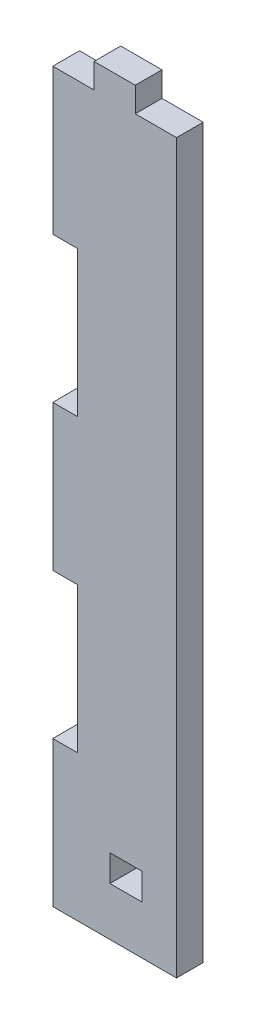
ISO-10303-21;
HEADER;
FILE_DESCRIPTION(('STEP AP214'),'2;1');
FILE_NAME('part.step','',(''),(''),'','','');
FILE_SCHEMA(('AUTOMOTIVE_DESIGN { 1 0 10303 214 1 1 1 1 }'));
ENDSEC;
DATA;
#1=APPLICATION_CONTEXT('core data for automotive mechanical design processes');
#2=APPLICATION_PROTOCOL_DEFINITION('international standard','automotive_design',2000,#1);
#3=PRODUCT_CONTEXT('',#1,'mechanical');
#4=PRODUCT('Part','Part','',(#3));
#5=PRODUCT_RELATED_PRODUCT_CATEGORY('part','',(#4));
#6=PRODUCT_DEFINITION_FORMATION('','',#4);
#7=PRODUCT_DEFINITION_CONTEXT('part definition',#1,'design');
#8=PRODUCT_DEFINITION('design','',#6,#7);
#9=PRODUCT_DEFINITION_SHAPE('','',#8);
#10=(LENGTH_UNIT() NAMED_UNIT(*) SI_UNIT(.MILLI.,.METRE.));
#11=(NAMED_UNIT(*) PLANE_ANGLE_UNIT() SI_UNIT($,.RADIAN.));
#12=(NAMED_UNIT(*) SI_UNIT($,.STERADIAN.) SOLID_ANGLE_UNIT());
#13=UNCERTAINTY_MEASURE_WITH_UNIT(LENGTH_MEASURE(1.E-05),#10,'distance_accuracy_value','');
#14=(GEOMETRIC_REPRESENTATION_CONTEXT(3) GLOBAL_UNCERTAINTY_ASSIGNED_CONTEXT((#13)) GLOBAL_UNIT_ASSIGNED_CONTEXT((#10,
#11,#12)) REPRESENTATION_CONTEXT('',''));
#15=CARTESIAN_POINT('',(0.,0.,0.));
#16=DIRECTION('',(0.,0.,1.));
#17=DIRECTION('',(1.,0.,0.));
#18=AXIS2_PLACEMENT_3D('',#15,#16,#17);
#19=CARTESIAN_POINT('',(0.,150.,5.5));
#20=DIRECTION('',(0.,-1.,0.));
#21=DIRECTION('',(0.,0.,-1.));
#22=AXIS2_PLACEMENT_3D('',#19,#20,#21);
#23=PLANE('',#22);
#24=DIRECTION('',(0.,0.,1.));
#25=VECTOR('',#24,1.);
#26=CARTESIAN_POINT('',(8.49999999999997,150.,-9.91261822123701));
#27=LINE('',#26,#25);
#28=CARTESIAN_POINT('',(8.49999999999997,150.,0.));
#29=VERTEX_POINT('',#28);
#30=CARTESIAN_POINT('',(8.49999999999997,150.,5.5));
#31=VERTEX_POINT('',#30);
#32=EDGE_CURVE('E251',#29,#31,#27,.T.);
#33=ORIENTED_EDGE('',*,*,#32,.F.);
#34=DIRECTION('',(-1.,0.,0.));
#35=VECTOR('',#34,1.);
#36=CARTESIAN_POINT('',(0.,150.,0.));
#37=LINE('',#36,#35);
#38=CARTESIAN_POINT('',(0.,150.,0.));
#39=VERTEX_POINT('',#38);
#40=EDGE_CURVE('E193',#29,#39,#37,.T.);
#41=ORIENTED_EDGE('',*,*,#40,.T.);
#42=DIRECTION('',(0.,0.,-1.));
#43=VECTOR('',#42,1.);
#44=CARTESIAN_POINT('',(0.,150.,5.5));
#45=LINE('',#44,#43);
#46=CARTESIAN_POINT('',(0.,150.,5.5));
#47=VERTEX_POINT('',#46);
#48=EDGE_CURVE('E207',#47,#39,#45,.T.);
#49=ORIENTED_EDGE('',*,*,#48,.F.);
#50=DIRECTION('',(-1.,0.,0.));
#51=VECTOR('',#50,1.);
#52=CARTESIAN_POINT('',(0.,150.,5.5));
#53=LINE('',#52,#51);
#54=EDGE_CURVE('E306',#31,#47,#53,.T.);
#55=ORIENTED_EDGE('',*,*,#54,.F.);
#56=EDGE_LOOP('',(#33,#41,#49,#55));
#57=FACE_BOUND('',#56,.T.);
#58=ADVANCED_FACE('F31',(#57),#23,.F.);
#59=CARTESIAN_POINT('',(0.,0.,5.5));
#60=DIRECTION('',(1.,0.,0.));
#61=DIRECTION('',(0.,1.,0.));
#62=AXIS2_PLACEMENT_3D('',#59,#60,#61);
#63=PLANE('',#62);
#64=DIRECTION('',(0.,0.,1.));
#65=VECTOR('',#64,1.);
#66=CARTESIAN_POINT('',(0.,30.,5.49999999999992));
#67=LINE('',#66,#65);
#68=CARTESIAN_POINT('',(0.,30.,0.));
#69=VERTEX_POINT('',#68);
#70=CARTESIAN_POINT('',(0.,30.,5.5));
#71=VERTEX_POINT('',#70);
#72=EDGE_CURVE('E298',#69,#71,#67,.T.);
#73=ORIENTED_EDGE('',*,*,#72,.F.);
#74=DIRECTION('',(0.,-1.,0.));
#75=VECTOR('',#74,1.);
#76=CARTESIAN_POINT('',(0.,0.,0.));
#77=LINE('',#76,#75);
#78=CARTESIAN_POINT('',(0.,0.,0.));
#79=VERTEX_POINT('',#78);
#80=EDGE_CURVE('E299',#69,#79,#77,.T.);
#81=ORIENTED_EDGE('',*,*,#80,.T.);
#82=DIRECTION('',(0.,0.,-1.));
#83=VECTOR('',#82,1.);
#84=CARTESIAN_POINT('',(0.,0.,5.5));
#85=LINE('',#84,#83);
#86=CARTESIAN_POINT('',(0.,0.,5.5));
#87=VERTEX_POINT('',#86);
#88=EDGE_CURVE('E216',#87,#79,#85,.T.);
#89=ORIENTED_EDGE('',*,*,#88,.F.);
#90=DIRECTION('',(0.,-1.,0.));
#91=VECTOR('',#90,1.);
#92=CARTESIAN_POINT('',(0.,0.,5.5));
#93=LINE('',#92,#91);
#94=EDGE_CURVE('E192',#71,#87,#93,.T.);
#95=ORIENTED_EDGE('',*,*,#94,.F.);
#96=EDGE_LOOP('',(#73,#81,#89,#95));
#97=FACE_BOUND('',#96,.T.);
#98=ADVANCED_FACE('F33',(#97),#63,.F.);
#99=DIRECTION('',(0.,0.,-1.));
#100=VECTOR('',#99,1.);
#101=CARTESIAN_POINT('',(0.,60.,5.50000000000015));
#102=LINE('',#101,#100);
#103=CARTESIAN_POINT('',(0.,60.,5.5));
#104=VERTEX_POINT('',#103);
#105=CARTESIAN_POINT('',(0.,60.,0.));
#106=VERTEX_POINT('',#105);
#107=EDGE_CURVE('E296',#104,#106,#102,.T.);
#108=ORIENTED_EDGE('',*,*,#107,.F.);
#109=CARTESIAN_POINT('',(0.,90.,5.5));
#110=VERTEX_POINT('',#109);
#111=EDGE_CURVE('E195',#110,#104,#93,.T.);
#112=ORIENTED_EDGE('',*,*,#111,.F.);
#113=DIRECTION('',(0.,0.,1.));
#114=VECTOR('',#113,1.);
#115=CARTESIAN_POINT('',(0.,90.,5.49999999999989));
#116=LINE('',#115,#114);
#117=CARTESIAN_POINT('',(0.,90.,0.));
#118=VERTEX_POINT('',#117);
#119=EDGE_CURVE('E294',#118,#110,#116,.T.);
#120=ORIENTED_EDGE('',*,*,#119,.F.);
#121=EDGE_CURVE('E351',#118,#106,#77,.T.);
#122=ORIENTED_EDGE('',*,*,#121,.T.);
#123=EDGE_LOOP('',(#108,#112,#120,#122));
#124=FACE_BOUND('',#123,.T.);
#125=ADVANCED_FACE('F349',(#124),#63,.F.);
#126=DIRECTION('',(0.,0.,-1.));
#127=VECTOR('',#126,1.);
#128=CARTESIAN_POINT('',(0.,120.,5.5));
#129=LINE('',#128,#127);
#130=CARTESIAN_POINT('',(0.,120.,5.5));
#131=VERTEX_POINT('',#130);
#132=CARTESIAN_POINT('',(0.,120.,0.));
#133=VERTEX_POINT('',#132);
#134=EDGE_CURVE('E292',#131,#133,#129,.T.);
#135=ORIENTED_EDGE('',*,*,#134,.F.);
#136=EDGE_CURVE('E197',#47,#131,#93,.T.);
#137=ORIENTED_EDGE('',*,*,#136,.F.);
#138=ORIENTED_EDGE('',*,*,#48,.T.);
#139=EDGE_CURVE('E309',#39,#133,#77,.T.);
#140=ORIENTED_EDGE('',*,*,#139,.T.);
#141=EDGE_LOOP('',(#135,#137,#138,#140));
#142=FACE_BOUND('',#141,.T.);
#143=ADVANCED_FACE('F330',(#142),#63,.F.);
#144=CARTESIAN_POINT('',(0.,150.,5.5));
#145=DIRECTION('',(0.,0.,-1.));
#146=DIRECTION('',(-1.,0.,0.));
#147=AXIS2_PLACEMENT_3D('',#144,#145,#146);
#148=PLANE('',#147);
#149=DIRECTION('',(0.,-1.,0.));
#150=VECTOR('',#149,1.);
#151=CARTESIAN_POINT('',(11.7666666666667,15.5,5.50000000000003));
#152=LINE('',#151,#150);
#153=CARTESIAN_POINT('',(11.7666666666667,15.5,5.50000000000003));
#154=VERTEX_POINT('',#153);
#155=CARTESIAN_POINT('',(11.7666666666667,10.,5.5));
#156=VERTEX_POINT('',#155);
#157=EDGE_CURVE('E56',#154,#156,#152,.T.);
#158=ORIENTED_EDGE('',*,*,#157,.F.);
#159=DIRECTION('',(1.,0.,0.));
#160=VECTOR('',#159,1.);
#161=CARTESIAN_POINT('',(11.7666666666667,15.5,5.50000000000003));
#162=LINE('',#161,#160);
#163=CARTESIAN_POINT('',(18.4333333333334,15.5,5.50000000000003));
#164=VERTEX_POINT('',#163);
#165=EDGE_CURVE('E445',#154,#164,#162,.T.);
#166=ORIENTED_EDGE('',*,*,#165,.T.);
#167=DIRECTION('',(0.,-1.,0.));
#168=VECTOR('',#167,1.);
#169=CARTESIAN_POINT('',(18.4333333333334,15.5,5.50000000000003));
#170=LINE('',#169,#168);
#171=CARTESIAN_POINT('',(18.4333333333334,10.,5.50000000000003));
#172=VERTEX_POINT('',#171);
#173=EDGE_CURVE('E263',#164,#172,#170,.T.);
#174=ORIENTED_EDGE('',*,*,#173,.T.);
#175=DIRECTION('',(1.,0.,0.));
#176=VECTOR('',#175,1.);
#177=CARTESIAN_POINT('',(11.7666666666667,10.,5.50000000000003));
#178=LINE('',#177,#176);
#179=EDGE_CURVE('E250',#156,#172,#178,.T.);
#180=ORIENTED_EDGE('',*,*,#179,.F.);
#181=EDGE_LOOP('',(#158,#166,#174,#180));
#182=FACE_BOUND('',#181,.T.);
#183=DIRECTION('',(1.,0.,0.));
#184=VECTOR('',#183,1.);
#185=CARTESIAN_POINT('',(-0.400000000000039,30.,5.5));
#186=LINE('',#185,#184);
#187=CARTESIAN_POINT('',(5.09999999999996,30.,5.5));
#188=VERTEX_POINT('',#187);
#189=EDGE_CURVE('E290',#71,#188,#186,.T.);
#190=ORIENTED_EDGE('',*,*,#189,.F.);
#191=ORIENTED_EDGE('',*,*,#94,.T.);
#192=DIRECTION('',(1.,0.,0.));
#193=VECTOR('',#192,1.);
#194=CARTESIAN_POINT('',(0.,0.,5.5));
#195=LINE('',#194,#193);
#196=CARTESIAN_POINT('',(25.5,0.,5.5));
#197=VERTEX_POINT('',#196);
#198=EDGE_CURVE('E302',#87,#197,#195,.T.);
#199=ORIENTED_EDGE('',*,*,#198,.T.);
#200=DIRECTION('',(0.,1.,0.));
#201=VECTOR('',#200,1.);
#202=CARTESIAN_POINT('',(25.5,0.,5.5));
#203=LINE('',#202,#201);
#204=CARTESIAN_POINT('',(25.5,150.,5.5));
#205=VERTEX_POINT('',#204);
#206=EDGE_CURVE('E304',#197,#205,#203,.T.);
#207=ORIENTED_EDGE('',*,*,#206,.T.);
#208=CARTESIAN_POINT('',(17.,150.,5.5));
#209=VERTEX_POINT('',#208);
#210=EDGE_CURVE('E211',#205,#209,#53,.T.);
#211=ORIENTED_EDGE('',*,*,#210,.T.);
#212=DIRECTION('',(0.,1.,0.));
#213=VECTOR('',#212,1.);
#214=CARTESIAN_POINT('',(17.,150.,5.5));
#215=LINE('',#214,#213);
#216=CARTESIAN_POINT('',(17.,155.1,5.5));
#217=VERTEX_POINT('',#216);
#218=EDGE_CURVE('E48',#209,#217,#215,.T.);
#219=ORIENTED_EDGE('',*,*,#218,.T.);
#220=DIRECTION('',(-1.,0.,0.));
#221=VECTOR('',#220,1.);
#222=CARTESIAN_POINT('',(8.49999999999997,155.1,5.5));
#223=LINE('',#222,#221);
#224=CARTESIAN_POINT('',(8.49999999999997,155.1,5.5));
#225=VERTEX_POINT('',#224);
#226=EDGE_CURVE('E186',#217,#225,#223,.T.);
#227=ORIENTED_EDGE('',*,*,#226,.T.);
#228=DIRECTION('',(0.,-1.,0.));
#229=VECTOR('',#228,1.);
#230=CARTESIAN_POINT('',(8.49999999999997,150.,5.5));
#231=LINE('',#230,#229);
#232=EDGE_CURVE('E322',#225,#31,#231,.T.);
#233=ORIENTED_EDGE('',*,*,#232,.T.);
#234=ORIENTED_EDGE('',*,*,#54,.T.);
#235=ORIENTED_EDGE('',*,*,#136,.T.);
#236=DIRECTION('',(1.,0.,0.));
#237=VECTOR('',#236,1.);
#238=CARTESIAN_POINT('',(-0.400000000000057,120.,5.5));
#239=LINE('',#238,#237);
#240=CARTESIAN_POINT('',(5.09999999999994,120.,5.5));
#241=VERTEX_POINT('',#240);
#242=EDGE_CURVE('E282',#131,#241,#239,.T.);
#243=ORIENTED_EDGE('',*,*,#242,.T.);
#244=DIRECTION('',(0.,1.,0.));
#245=VECTOR('',#244,1.);
#246=CARTESIAN_POINT('',(5.09999999999995,90.,5.5));
#247=LINE('',#246,#245);
#248=CARTESIAN_POINT('',(5.09999999999995,90.,5.5));
#249=VERTEX_POINT('',#248);
#250=EDGE_CURVE('E278',#249,#241,#247,.T.);
#251=ORIENTED_EDGE('',*,*,#250,.F.);
#252=DIRECTION('',(1.,0.,0.));
#253=VECTOR('',#252,1.);
#254=CARTESIAN_POINT('',(-0.40000000000005,90.,5.5));
#255=LINE('',#254,#253);
#256=EDGE_CURVE('E285',#110,#249,#255,.T.);
#257=ORIENTED_EDGE('',*,*,#256,.F.);
#258=ORIENTED_EDGE('',*,*,#111,.T.);
#259=DIRECTION('',(1.,0.,0.));
#260=VECTOR('',#259,1.);
#261=CARTESIAN_POINT('',(-0.400000000000045,60.,5.5));
#262=LINE('',#261,#260);
#263=CARTESIAN_POINT('',(5.09999999999995,60.,5.5));
#264=VERTEX_POINT('',#263);
#265=EDGE_CURVE('E287',#104,#264,#262,.T.);
#266=ORIENTED_EDGE('',*,*,#265,.T.);
#267=DIRECTION('',(0.,1.,0.));
#268=VECTOR('',#267,1.);
#269=CARTESIAN_POINT('',(5.09999999999996,30.,5.5));
#270=LINE('',#269,#268);
#271=EDGE_CURVE('E271',#188,#264,#270,.T.);
#272=ORIENTED_EDGE('',*,*,#271,.F.);
#273=EDGE_LOOP('',(#190,#191,#199,#207,#211,#219,#227,#233,#234,#235,#243,#251,#257,#258,#266,#272));
#274=FACE_BOUND('',#273,.T.);
#275=ADVANCED_FACE('F318',(#182,#274),#148,.F.);
#276=CARTESIAN_POINT('',(0.,150.,0.));
#277=DIRECTION('',(0.,0.,-1.));
#278=DIRECTION('',(-1.,0.,0.));
#279=AXIS2_PLACEMENT_3D('',#276,#277,#278);
#280=PLANE('',#279);
#281=DIRECTION('',(1.,0.,0.));
#282=VECTOR('',#281,1.);
#283=CARTESIAN_POINT('',(0.,15.5,0.));
#284=LINE('',#283,#282);
#285=CARTESIAN_POINT('',(11.7666666666667,15.5,0.));
#286=VERTEX_POINT('',#285);
#287=CARTESIAN_POINT('',(18.4333333333334,15.5,0.));
#288=VERTEX_POINT('',#287);
#289=EDGE_CURVE('E11',#286,#288,#284,.T.);
#290=ORIENTED_EDGE('',*,*,#289,.F.);
#291=DIRECTION('',(0.,-1.,0.));
#292=VECTOR('',#291,1.);
#293=CARTESIAN_POINT('',(11.7666666666667,15.5,0.));
#294=LINE('',#293,#292);
#295=CARTESIAN_POINT('',(11.7666666666667,10.,0.));
#296=VERTEX_POINT('',#295);
#297=EDGE_CURVE('E240',#286,#296,#294,.T.);
#298=ORIENTED_EDGE('',*,*,#297,.T.);
#299=DIRECTION('',(1.,0.,0.));
#300=VECTOR('',#299,1.);
#301=CARTESIAN_POINT('',(0.,10.,0.));
#302=LINE('',#301,#300);
#303=CARTESIAN_POINT('',(18.4333333333334,10.,0.));
#304=VERTEX_POINT('',#303);
#305=EDGE_CURVE('E40',#296,#304,#302,.T.);
#306=ORIENTED_EDGE('',*,*,#305,.T.);
#307=DIRECTION('',(0.,-1.,0.));
#308=VECTOR('',#307,1.);
#309=CARTESIAN_POINT('',(18.4333333333334,15.5,0.));
#310=LINE('',#309,#308);
#311=EDGE_CURVE('E239',#288,#304,#310,.T.);
#312=ORIENTED_EDGE('',*,*,#311,.F.);
#313=EDGE_LOOP('',(#290,#298,#306,#312));
#314=FACE_BOUND('',#313,.T.);
#315=DIRECTION('',(0.,1.,0.));
#316=VECTOR('',#315,1.);
#317=CARTESIAN_POINT('',(25.5,0.,0.));
#318=LINE('',#317,#316);
#319=CARTESIAN_POINT('',(25.5,0.,0.));
#320=VERTEX_POINT('',#319);
#321=CARTESIAN_POINT('',(25.5,150.,0.));
#322=VERTEX_POINT('',#321);
#323=EDGE_CURVE('E198',#320,#322,#318,.T.);
#324=ORIENTED_EDGE('',*,*,#323,.F.);
#325=DIRECTION('',(1.,0.,0.));
#326=VECTOR('',#325,1.);
#327=CARTESIAN_POINT('',(0.,0.,0.));
#328=LINE('',#327,#326);
#329=EDGE_CURVE('E372',#79,#320,#328,.T.);
#330=ORIENTED_EDGE('',*,*,#329,.F.);
#331=ORIENTED_EDGE('',*,*,#80,.F.);
#332=DIRECTION('',(1.,0.,0.));
#333=VECTOR('',#332,1.);
#334=CARTESIAN_POINT('',(0.,30.,0.));
#335=LINE('',#334,#333);
#336=CARTESIAN_POINT('',(5.09999999999996,30.,0.));
#337=VERTEX_POINT('',#336);
#338=EDGE_CURVE('E232',#69,#337,#335,.T.);
#339=ORIENTED_EDGE('',*,*,#338,.T.);
#340=DIRECTION('',(0.,1.,0.));
#341=VECTOR('',#340,1.);
#342=CARTESIAN_POINT('',(5.09999999999994,150.,0.));
#343=LINE('',#342,#341);
#344=CARTESIAN_POINT('',(5.09999999999995,60.,0.));
#345=VERTEX_POINT('',#344);
#346=EDGE_CURVE('E220',#337,#345,#343,.T.);
#347=ORIENTED_EDGE('',*,*,#346,.T.);
#348=DIRECTION('',(-1.,0.,0.));
#349=VECTOR('',#348,1.);
#350=CARTESIAN_POINT('',(0.,60.,0.));
#351=LINE('',#350,#349);
#352=EDGE_CURVE('E229',#345,#106,#351,.T.);
#353=ORIENTED_EDGE('',*,*,#352,.T.);
#354=ORIENTED_EDGE('',*,*,#121,.F.);
#355=DIRECTION('',(1.,0.,0.));
#356=VECTOR('',#355,1.);
#357=CARTESIAN_POINT('',(0.,90.,0.));
#358=LINE('',#357,#356);
#359=CARTESIAN_POINT('',(5.09999999999995,90.,0.));
#360=VERTEX_POINT('',#359);
#361=EDGE_CURVE('E226',#118,#360,#358,.T.);
#362=ORIENTED_EDGE('',*,*,#361,.T.);
#363=CARTESIAN_POINT('',(5.09999999999994,120.,0.));
#364=VERTEX_POINT('',#363);
#365=EDGE_CURVE('E219',#360,#364,#343,.T.);
#366=ORIENTED_EDGE('',*,*,#365,.T.);
#367=DIRECTION('',(-1.,0.,0.));
#368=VECTOR('',#367,1.);
#369=CARTESIAN_POINT('',(0.,120.,0.));
#370=LINE('',#369,#368);
#371=EDGE_CURVE('E223',#364,#133,#370,.T.);
#372=ORIENTED_EDGE('',*,*,#371,.T.);
#373=ORIENTED_EDGE('',*,*,#139,.F.);
#374=ORIENTED_EDGE('',*,*,#40,.F.);
#375=DIRECTION('',(0.,-1.,0.));
#376=VECTOR('',#375,1.);
#377=CARTESIAN_POINT('',(8.49999999999997,150.,0.));
#378=LINE('',#377,#376);
#379=CARTESIAN_POINT('',(8.49999999999997,155.1,0.));
#380=VERTEX_POINT('',#379);
#381=EDGE_CURVE('E254',#380,#29,#378,.T.);
#382=ORIENTED_EDGE('',*,*,#381,.F.);
#383=DIRECTION('',(-1.,0.,0.));
#384=VECTOR('',#383,1.);
#385=CARTESIAN_POINT('',(8.49999999999997,155.1,0.));
#386=LINE('',#385,#384);
#387=CARTESIAN_POINT('',(17.,155.1,0.));
#388=VERTEX_POINT('',#387);
#389=EDGE_CURVE('E177',#388,#380,#386,.T.);
#390=ORIENTED_EDGE('',*,*,#389,.F.);
#391=DIRECTION('',(0.,1.,0.));
#392=VECTOR('',#391,1.);
#393=CARTESIAN_POINT('',(17.,150.,0.));
#394=LINE('',#393,#392);
#395=CARTESIAN_POINT('',(17.,150.,0.));
#396=VERTEX_POINT('',#395);
#397=EDGE_CURVE('E171',#396,#388,#394,.T.);
#398=ORIENTED_EDGE('',*,*,#397,.F.);
#399=EDGE_CURVE('E175',#322,#396,#37,.T.);
#400=ORIENTED_EDGE('',*,*,#399,.F.);
#401=EDGE_LOOP('',(#324,#330,#331,#339,#347,#353,#354,#362,#366,#372,#373,#374,#382,#390,#398,#400));
#402=FACE_BOUND('',#401,.T.);
#403=ADVANCED_FACE('F173',(#314,#402),#280,.T.);
#404=CARTESIAN_POINT('',(0.,0.,5.5));
#405=DIRECTION('',(0.,1.,0.));
#406=DIRECTION('',(0.,0.,1.));
#407=AXIS2_PLACEMENT_3D('',#404,#405,#406);
#408=PLANE('',#407);
#409=ORIENTED_EDGE('',*,*,#329,.T.);
#410=DIRECTION('',(0.,0.,-1.));
#411=VECTOR('',#410,1.);
#412=CARTESIAN_POINT('',(25.5,0.,5.5));
#413=LINE('',#412,#411);
#414=EDGE_CURVE('E213',#197,#320,#413,.T.);
#415=ORIENTED_EDGE('',*,*,#414,.F.);
#416=ORIENTED_EDGE('',*,*,#198,.F.);
#417=ORIENTED_EDGE('',*,*,#88,.T.);
#418=EDGE_LOOP('',(#409,#415,#416,#417));
#419=FACE_BOUND('',#418,.T.);
#420=ADVANCED_FACE('F370',(#419),#408,.F.);
#421=CARTESIAN_POINT('',(25.5,0.,5.5));
#422=DIRECTION('',(-1.,0.,0.));
#423=DIRECTION('',(0.,-1.,0.));
#424=AXIS2_PLACEMENT_3D('',#421,#422,#423);
#425=PLANE('',#424);
#426=ORIENTED_EDGE('',*,*,#323,.T.);
#427=DIRECTION('',(0.,0.,-1.));
#428=VECTOR('',#427,1.);
#429=CARTESIAN_POINT('',(25.5,150.,5.5));
#430=LINE('',#429,#428);
#431=EDGE_CURVE('E191',#205,#322,#430,.T.);
#432=ORIENTED_EDGE('',*,*,#431,.F.);
#433=ORIENTED_EDGE('',*,*,#206,.F.);
#434=ORIENTED_EDGE('',*,*,#414,.T.);
#435=EDGE_LOOP('',(#426,#432,#433,#434));
#436=FACE_BOUND('',#435,.T.);
#437=ADVANCED_FACE('F375',(#436),#425,.F.);
#438=ORIENTED_EDGE('',*,*,#399,.T.);
#439=DIRECTION('',(0.,0.,1.));
#440=VECTOR('',#439,1.);
#441=CARTESIAN_POINT('',(17.,150.,-9.91261822123701));
#442=LINE('',#441,#440);
#443=EDGE_CURVE('E180',#396,#209,#442,.T.);
#444=ORIENTED_EDGE('',*,*,#443,.T.);
#445=ORIENTED_EDGE('',*,*,#210,.F.);
#446=ORIENTED_EDGE('',*,*,#431,.T.);
#447=EDGE_LOOP('',(#438,#444,#445,#446));
#448=FACE_BOUND('',#447,.T.);
#449=ADVANCED_FACE('F189',(#448),#23,.F.);
#450=CARTESIAN_POINT('',(5.09999999999994,120.,0.));
#451=DIRECTION('',(-1.,0.,0.));
#452=DIRECTION('',(0.,0.,-1.));
#453=AXIS2_PLACEMENT_3D('',#450,#451,#452);
#454=PLANE('',#453);
#455=DIRECTION('',(0.,0.,1.));
#456=VECTOR('',#455,1.);
#457=CARTESIAN_POINT('',(5.09999999999995,90.,0.));
#458=LINE('',#457,#456);
#459=EDGE_CURVE('E275',#360,#249,#458,.T.);
#460=ORIENTED_EDGE('',*,*,#459,.T.);
#461=ORIENTED_EDGE('',*,*,#250,.T.);
#462=DIRECTION('',(0.,0.,-1.));
#463=VECTOR('',#462,1.);
#464=CARTESIAN_POINT('',(5.09999999999994,120.,0.));
#465=LINE('',#464,#463);
#466=EDGE_CURVE('E280',#241,#364,#465,.T.);
#467=ORIENTED_EDGE('',*,*,#466,.T.);
#468=ORIENTED_EDGE('',*,*,#365,.F.);
#469=EDGE_LOOP('',(#460,#461,#467,#468));
#470=FACE_BOUND('',#469,.T.);
#471=ADVANCED_FACE('F339',(#470),#454,.T.);
#472=CARTESIAN_POINT('',(-0.400000000000057,120.,0.));
#473=DIRECTION('',(0.,-1.,0.));
#474=DIRECTION('',(-1.,0.,0.));
#475=AXIS2_PLACEMENT_3D('',#472,#473,#474);
#476=PLANE('',#475);
#477=ORIENTED_EDGE('',*,*,#134,.T.);
#478=ORIENTED_EDGE('',*,*,#371,.F.);
#479=ORIENTED_EDGE('',*,*,#466,.F.);
#480=ORIENTED_EDGE('',*,*,#242,.F.);
#481=EDGE_LOOP('',(#477,#478,#479,#480));
#482=FACE_BOUND('',#481,.T.);
#483=ADVANCED_FACE('F333',(#482),#476,.T.);
#484=CARTESIAN_POINT('',(-0.40000000000005,90.,0.));
#485=DIRECTION('',(0.,1.,0.));
#486=DIRECTION('',(0.,0.,-1.));
#487=AXIS2_PLACEMENT_3D('',#484,#485,#486);
#488=PLANE('',#487);
#489=ORIENTED_EDGE('',*,*,#119,.T.);
#490=ORIENTED_EDGE('',*,*,#256,.T.);
#491=ORIENTED_EDGE('',*,*,#459,.F.);
#492=ORIENTED_EDGE('',*,*,#361,.F.);
#493=EDGE_LOOP('',(#489,#490,#491,#492));
#494=FACE_BOUND('',#493,.T.);
#495=ADVANCED_FACE('F342',(#494),#488,.T.);
#496=CARTESIAN_POINT('',(-0.400000000000039,30.,0.));
#497=DIRECTION('',(0.,1.,0.));
#498=DIRECTION('',(0.,0.,-1.));
#499=AXIS2_PLACEMENT_3D('',#496,#497,#498);
#500=PLANE('',#499);
#501=ORIENTED_EDGE('',*,*,#72,.T.);
#502=ORIENTED_EDGE('',*,*,#189,.T.);
#503=DIRECTION('',(0.,0.,1.));
#504=VECTOR('',#503,1.);
#505=CARTESIAN_POINT('',(5.09999999999996,30.,0.));
#506=LINE('',#505,#504);
#507=EDGE_CURVE('E268',#337,#188,#506,.T.);
#508=ORIENTED_EDGE('',*,*,#507,.F.);
#509=ORIENTED_EDGE('',*,*,#338,.F.);
#510=EDGE_LOOP('',(#501,#502,#508,#509));
#511=FACE_BOUND('',#510,.T.);
#512=ADVANCED_FACE('F362',(#511),#500,.T.);
#513=CARTESIAN_POINT('',(-0.400000000000045,60.,0.));
#514=DIRECTION('',(0.,-1.,0.));
#515=DIRECTION('',(0.,0.,1.));
#516=AXIS2_PLACEMENT_3D('',#513,#514,#515);
#517=PLANE('',#516);
#518=ORIENTED_EDGE('',*,*,#107,.T.);
#519=ORIENTED_EDGE('',*,*,#352,.F.);
#520=DIRECTION('',(0.,0.,-1.));
#521=VECTOR('',#520,1.);
#522=CARTESIAN_POINT('',(5.09999999999995,60.,0.));
#523=LINE('',#522,#521);
#524=EDGE_CURVE('E273',#264,#345,#523,.T.);
#525=ORIENTED_EDGE('',*,*,#524,.F.);
#526=ORIENTED_EDGE('',*,*,#265,.F.);
#527=EDGE_LOOP('',(#518,#519,#525,#526));
#528=FACE_BOUND('',#527,.T.);
#529=ADVANCED_FACE('F354',(#528),#517,.T.);
#530=ORIENTED_EDGE('',*,*,#507,.T.);
#531=ORIENTED_EDGE('',*,*,#271,.T.);
#532=ORIENTED_EDGE('',*,*,#524,.T.);
#533=ORIENTED_EDGE('',*,*,#346,.F.);
#534=EDGE_LOOP('',(#530,#531,#532,#533));
#535=FACE_BOUND('',#534,.T.);
#536=ADVANCED_FACE('F359',(#535),#454,.T.);
#537=CARTESIAN_POINT('',(11.7666666666667,15.5,0.));
#538=DIRECTION('',(1.,0.,0.));
#539=DIRECTION('',(0.,-1.,0.));
#540=AXIS2_PLACEMENT_3D('',#537,#538,#539);
#541=PLANE('',#540);
#542=DIRECTION('',(0.,0.,1.));
#543=VECTOR('',#542,1.);
#544=CARTESIAN_POINT('',(11.7666666666667,10.,0.));
#545=LINE('',#544,#543);
#546=EDGE_CURVE('E244',#296,#156,#545,.T.);
#547=ORIENTED_EDGE('',*,*,#546,.F.);
#548=ORIENTED_EDGE('',*,*,#297,.F.);
#549=DIRECTION('',(0.,0.,1.));
#550=VECTOR('',#549,1.);
#551=CARTESIAN_POINT('',(11.7666666666667,15.5,0.));
#552=LINE('',#551,#550);
#553=EDGE_CURVE('E261',#286,#154,#552,.T.);
#554=ORIENTED_EDGE('',*,*,#553,.T.);
#555=ORIENTED_EDGE('',*,*,#157,.T.);
#556=EDGE_LOOP('',(#547,#548,#554,#555));
#557=FACE_BOUND('',#556,.T.);
#558=ADVANCED_FACE('F248',(#557),#541,.T.);
#559=CARTESIAN_POINT('',(18.4333333333334,15.5,0.));
#560=DIRECTION('',(-1.,0.,0.));
#561=DIRECTION('',(0.,1.,0.));
#562=AXIS2_PLACEMENT_3D('',#559,#560,#561);
#563=PLANE('',#562);
#564=DIRECTION('',(0.,0.,-1.));
#565=VECTOR('',#564,1.);
#566=CARTESIAN_POINT('',(18.4333333333334,10.,0.));
#567=LINE('',#566,#565);
#568=EDGE_CURVE('E247',#172,#304,#567,.T.);
#569=ORIENTED_EDGE('',*,*,#568,.F.);
#570=ORIENTED_EDGE('',*,*,#173,.F.);
#571=DIRECTION('',(0.,0.,-1.));
#572=VECTOR('',#571,1.);
#573=CARTESIAN_POINT('',(18.4333333333334,15.5,0.));
#574=LINE('',#573,#572);
#575=EDGE_CURVE('E257',#164,#288,#574,.T.);
#576=ORIENTED_EDGE('',*,*,#575,.T.);
#577=ORIENTED_EDGE('',*,*,#311,.T.);
#578=EDGE_LOOP('',(#569,#570,#576,#577));
#579=FACE_BOUND('',#578,.T.);
#580=ADVANCED_FACE('F405',(#579),#563,.T.);
#581=CARTESIAN_POINT('',(5.10000000000003,15.5,-6.66666666666664));
#582=DIRECTION('',(0.,1.,0.));
#583=DIRECTION('',(1.,0.,0.));
#584=AXIS2_PLACEMENT_3D('',#581,#582,#583);
#585=PLANE('',#584);
#586=ORIENTED_EDGE('',*,*,#289,.T.);
#587=ORIENTED_EDGE('',*,*,#575,.F.);
#588=ORIENTED_EDGE('',*,*,#165,.F.);
#589=ORIENTED_EDGE('',*,*,#553,.F.);
#590=EDGE_LOOP('',(#586,#587,#588,#589));
#591=FACE_BOUND('',#590,.T.);
#592=ADVANCED_FACE('F408',(#591),#585,.F.);
#593=CARTESIAN_POINT('',(5.10000000000004,10.,-6.66666666666664));
#594=DIRECTION('',(0.,1.,0.));
#595=DIRECTION('',(1.,0.,0.));
#596=AXIS2_PLACEMENT_3D('',#593,#594,#595);
#597=PLANE('',#596);
#598=ORIENTED_EDGE('',*,*,#546,.T.);
#599=ORIENTED_EDGE('',*,*,#179,.T.);
#600=ORIENTED_EDGE('',*,*,#568,.T.);
#601=ORIENTED_EDGE('',*,*,#305,.F.);
#602=EDGE_LOOP('',(#598,#599,#600,#601));
#603=FACE_BOUND('',#602,.T.);
#604=ADVANCED_FACE('F243',(#603),#597,.T.);
#605=CARTESIAN_POINT('',(17.,150.,-9.91261822123701));
#606=DIRECTION('',(1.,0.,0.));
#607=DIRECTION('',(0.,1.,0.));
#608=AXIS2_PLACEMENT_3D('',#605,#606,#607);
#609=PLANE('',#608);
#610=ORIENTED_EDGE('',*,*,#443,.F.);
#611=ORIENTED_EDGE('',*,*,#397,.T.);
#612=DIRECTION('',(0.,0.,1.));
#613=VECTOR('',#612,1.);
#614=CARTESIAN_POINT('',(17.,155.1,-9.91261822123701));
#615=LINE('',#614,#613);
#616=EDGE_CURVE('E179',#388,#217,#615,.T.);
#617=ORIENTED_EDGE('',*,*,#616,.T.);
#618=ORIENTED_EDGE('',*,*,#218,.F.);
#619=EDGE_LOOP('',(#610,#611,#617,#618));
#620=FACE_BOUND('',#619,.T.);
#621=ADVANCED_FACE('F182',(#620),#609,.T.);
#622=CARTESIAN_POINT('',(8.49999999999997,155.1,-9.91261822123701));
#623=DIRECTION('',(0.,1.,0.));
#624=DIRECTION('',(0.,0.,1.));
#625=AXIS2_PLACEMENT_3D('',#622,#623,#624);
#626=PLANE('',#625);
#627=ORIENTED_EDGE('',*,*,#616,.F.);
#628=ORIENTED_EDGE('',*,*,#389,.T.);
#629=DIRECTION('',(0.,0.,1.));
#630=VECTOR('',#629,1.);
#631=CARTESIAN_POINT('',(8.49999999999997,155.1,-9.91261822123701));
#632=LINE('',#631,#630);
#633=EDGE_CURVE('E427',#380,#225,#632,.T.);
#634=ORIENTED_EDGE('',*,*,#633,.T.);
#635=ORIENTED_EDGE('',*,*,#226,.F.);
#636=EDGE_LOOP('',(#627,#628,#634,#635));
#637=FACE_BOUND('',#636,.T.);
#638=ADVANCED_FACE('F417',(#637),#626,.T.);
#639=CARTESIAN_POINT('',(8.49999999999997,150.,-9.91261822123701));
#640=DIRECTION('',(-1.,0.,0.));
#641=DIRECTION('',(0.,0.,1.));
#642=AXIS2_PLACEMENT_3D('',#639,#640,#641);
#643=PLANE('',#642);
#644=ORIENTED_EDGE('',*,*,#633,.F.);
#645=ORIENTED_EDGE('',*,*,#381,.T.);
#646=ORIENTED_EDGE('',*,*,#32,.T.);
#647=ORIENTED_EDGE('',*,*,#232,.F.);
#648=EDGE_LOOP('',(#644,#645,#646,#647));
#649=FACE_BOUND('',#648,.T.);
#650=ADVANCED_FACE('F420',(#649),#643,.T.);
#651=CLOSED_SHELL('',(#58,#98,#125,#143,#275,#403,#420,#437,#449,#471,#483,#495,#512,#529,#536,
#558,#580,#592,#604,#621,#638,#650));
#652=MANIFOLD_SOLID_BREP('B2',#651);
#653=ADVANCED_BREP_SHAPE_REPRESENTATION('',(#18,#652),#14);
#654=SHAPE_DEFINITION_REPRESENTATION(#9,#653);
ENDSEC;
END-ISO-10303-21;
